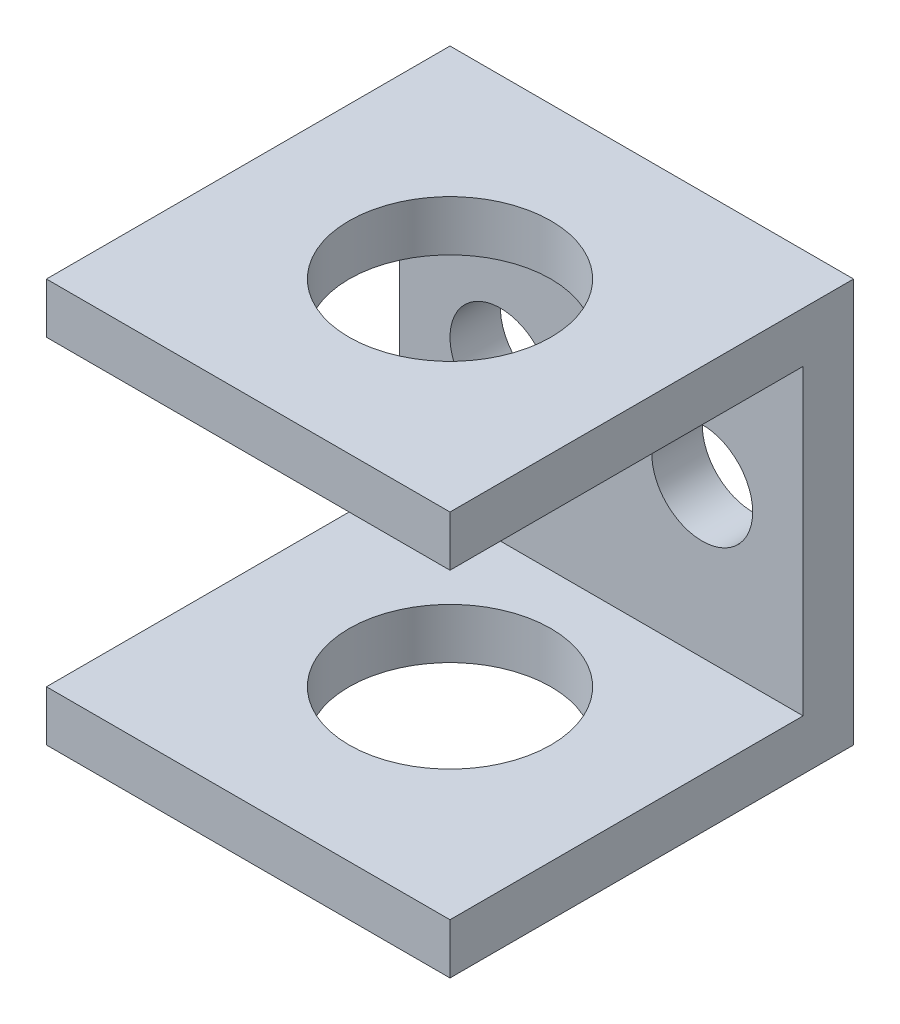
ISO-10303-21;
HEADER;
FILE_DESCRIPTION(('STEP AP214'),'2;1');
FILE_NAME('part.step','',(''),(''),'','','');
FILE_SCHEMA(('AUTOMOTIVE_DESIGN { 1 0 10303 214 1 1 1 1 }'));
ENDSEC;
DATA;
#1=APPLICATION_CONTEXT('core data for automotive mechanical design processes');
#2=APPLICATION_PROTOCOL_DEFINITION('international standard','automotive_design',2000,#1);
#3=PRODUCT_CONTEXT('',#1,'mechanical');
#4=PRODUCT('Part','Part','',(#3));
#5=PRODUCT_RELATED_PRODUCT_CATEGORY('part','',(#4));
#6=PRODUCT_DEFINITION_FORMATION('','',#4);
#7=PRODUCT_DEFINITION_CONTEXT('part definition',#1,'design');
#8=PRODUCT_DEFINITION('design','',#6,#7);
#9=PRODUCT_DEFINITION_SHAPE('','',#8);
#10=(LENGTH_UNIT() NAMED_UNIT(*) SI_UNIT(.MILLI.,.METRE.));
#11=(NAMED_UNIT(*) PLANE_ANGLE_UNIT() SI_UNIT($,.RADIAN.));
#12=(NAMED_UNIT(*) SI_UNIT($,.STERADIAN.) SOLID_ANGLE_UNIT());
#13=UNCERTAINTY_MEASURE_WITH_UNIT(LENGTH_MEASURE(1.E-05),#10,'distance_accuracy_value','');
#14=(GEOMETRIC_REPRESENTATION_CONTEXT(3) GLOBAL_UNCERTAINTY_ASSIGNED_CONTEXT((#13)) GLOBAL_UNIT_ASSIGNED_CONTEXT((#10,
#11,#12)) REPRESENTATION_CONTEXT('',''));
#15=CARTESIAN_POINT('',(0.,0.,0.));
#16=DIRECTION('',(0.,0.,1.));
#17=DIRECTION('',(1.,0.,0.));
#18=AXIS2_PLACEMENT_3D('',#15,#16,#17);
#19=CARTESIAN_POINT('',(0.,0.,20.));
#20=DIRECTION('',(0.,0.,-1.));
#21=DIRECTION('',(-1.,0.,0.));
#22=AXIS2_PLACEMENT_3D('',#19,#20,#21);
#23=PLANE('',#22);
#24=DIRECTION('',(0.,-1.,0.));
#25=VECTOR('',#24,1.);
#26=CARTESIAN_POINT('',(0.,0.,20.));
#27=LINE('',#26,#25);
#28=CARTESIAN_POINT('',(0.,20.,20.));
#29=VERTEX_POINT('',#28);
#30=CARTESIAN_POINT('',(0.,17.5,20.));
#31=VERTEX_POINT('',#30);
#32=EDGE_CURVE('E136',#29,#31,#27,.T.);
#33=ORIENTED_EDGE('',*,*,#32,.T.);
#34=DIRECTION('',(-1.,0.,0.));
#35=VECTOR('',#34,1.);
#36=CARTESIAN_POINT('',(0.,17.5,20.));
#37=LINE('',#36,#35);
#38=CARTESIAN_POINT('',(20.,17.5,20.));
#39=VERTEX_POINT('',#38);
#40=EDGE_CURVE('E127',#39,#31,#37,.T.);
#41=ORIENTED_EDGE('',*,*,#40,.F.);
#42=DIRECTION('',(0.,1.,0.));
#43=VECTOR('',#42,1.);
#44=CARTESIAN_POINT('',(20.,0.,20.));
#45=LINE('',#44,#43);
#46=CARTESIAN_POINT('',(20.,20.,20.));
#47=VERTEX_POINT('',#46);
#48=EDGE_CURVE('E140',#39,#47,#45,.T.);
#49=ORIENTED_EDGE('',*,*,#48,.T.);
#50=DIRECTION('',(-1.,0.,0.));
#51=VECTOR('',#50,1.);
#52=CARTESIAN_POINT('',(0.,20.,20.));
#53=LINE('',#52,#51);
#54=EDGE_CURVE('E61',#47,#29,#53,.T.);
#55=ORIENTED_EDGE('',*,*,#54,.T.);
#56=EDGE_LOOP('',(#33,#41,#49,#55));
#57=FACE_BOUND('',#56,.T.);
#58=ADVANCED_FACE('F36',(#57),#23,.F.);
#59=CARTESIAN_POINT('',(0.,0.,20.));
#60=DIRECTION('',(1.,0.,0.));
#61=DIRECTION('',(0.,0.,-1.));
#62=AXIS2_PLACEMENT_3D('',#59,#60,#61);
#63=PLANE('',#62);
#64=DIRECTION('',(0.,-1.,0.));
#65=VECTOR('',#64,1.);
#66=CARTESIAN_POINT('',(0.,17.5,2.5));
#67=LINE('',#66,#65);
#68=CARTESIAN_POINT('',(0.,17.5,2.5));
#69=VERTEX_POINT('',#68);
#70=CARTESIAN_POINT('',(0.,2.5,2.5));
#71=VERTEX_POINT('',#70);
#72=EDGE_CURVE('E118',#69,#71,#67,.T.);
#73=ORIENTED_EDGE('',*,*,#72,.F.);
#74=DIRECTION('',(0.,0.,1.));
#75=VECTOR('',#74,1.);
#76=CARTESIAN_POINT('',(0.,17.5,2.5));
#77=LINE('',#76,#75);
#78=EDGE_CURVE('E150',#69,#31,#77,.T.);
#79=ORIENTED_EDGE('',*,*,#78,.T.);
#80=ORIENTED_EDGE('',*,*,#32,.F.);
#81=DIRECTION('',(0.,0.,-1.));
#82=VECTOR('',#81,1.);
#83=CARTESIAN_POINT('',(0.,20.,20.));
#84=LINE('',#83,#82);
#85=CARTESIAN_POINT('',(0.,20.,0.));
#86=VERTEX_POINT('',#85);
#87=EDGE_CURVE('E145',#29,#86,#84,.T.);
#88=ORIENTED_EDGE('',*,*,#87,.T.);
#89=DIRECTION('',(0.,-1.,0.));
#90=VECTOR('',#89,1.);
#91=CARTESIAN_POINT('',(0.,0.,0.));
#92=LINE('',#91,#90);
#93=CARTESIAN_POINT('',(0.,0.,0.));
#94=VERTEX_POINT('',#93);
#95=EDGE_CURVE('E146',#86,#94,#92,.T.);
#96=ORIENTED_EDGE('',*,*,#95,.T.);
#97=DIRECTION('',(0.,0.,-1.));
#98=VECTOR('',#97,1.);
#99=CARTESIAN_POINT('',(0.,0.,20.));
#100=LINE('',#99,#98);
#101=CARTESIAN_POINT('',(0.,0.,20.));
#102=VERTEX_POINT('',#101);
#103=EDGE_CURVE('E11',#102,#94,#100,.T.);
#104=ORIENTED_EDGE('',*,*,#103,.F.);
#105=CARTESIAN_POINT('',(0.,2.5,20.));
#106=VERTEX_POINT('',#105);
#107=EDGE_CURVE('E89',#106,#102,#27,.T.);
#108=ORIENTED_EDGE('',*,*,#107,.F.);
#109=DIRECTION('',(0.,0.,1.));
#110=VECTOR('',#109,1.);
#111=CARTESIAN_POINT('',(0.,2.5,2.5));
#112=LINE('',#111,#110);
#113=EDGE_CURVE('E52',#71,#106,#112,.T.);
#114=ORIENTED_EDGE('',*,*,#113,.F.);
#115=EDGE_LOOP('',(#73,#79,#80,#88,#96,#104,#108,#114));
#116=FACE_BOUND('',#115,.T.);
#117=ADVANCED_FACE('F38',(#116),#63,.F.);
#118=CARTESIAN_POINT('',(0.,0.,20.));
#119=DIRECTION('',(0.,1.,0.));
#120=DIRECTION('',(0.,0.,1.));
#121=AXIS2_PLACEMENT_3D('',#118,#119,#120);
#122=PLANE('',#121);
#123=CARTESIAN_POINT('',(10.,0.,10.));
#124=DIRECTION('',(0.,1.,0.));
#125=DIRECTION('',(0.,0.,1.));
#126=AXIS2_PLACEMENT_3D('',#123,#124,#125);
#127=CIRCLE('',#126,5.);
#128=CARTESIAN_POINT('',(10.,0.,15.));
#129=VERTEX_POINT('',#128);
#130=EDGE_CURVE('E215',#129,#129,#127,.T.);
#131=ORIENTED_EDGE('',*,*,#130,.T.);
#132=EDGE_LOOP('',(#131));
#133=FACE_BOUND('',#132,.T.);
#134=DIRECTION('',(1.,0.,0.));
#135=VECTOR('',#134,1.);
#136=CARTESIAN_POINT('',(0.,0.,0.));
#137=LINE('',#136,#135);
#138=CARTESIAN_POINT('',(20.,0.,0.));
#139=VERTEX_POINT('',#138);
#140=EDGE_CURVE('E149',#94,#139,#137,.T.);
#141=ORIENTED_EDGE('',*,*,#140,.T.);
#142=DIRECTION('',(0.,0.,-1.));
#143=VECTOR('',#142,1.);
#144=CARTESIAN_POINT('',(20.,0.,20.));
#145=LINE('',#144,#143);
#146=CARTESIAN_POINT('',(20.,0.,20.));
#147=VERTEX_POINT('',#146);
#148=EDGE_CURVE('E45',#147,#139,#145,.T.);
#149=ORIENTED_EDGE('',*,*,#148,.F.);
#150=DIRECTION('',(1.,0.,0.));
#151=VECTOR('',#150,1.);
#152=CARTESIAN_POINT('',(0.,0.,20.));
#153=LINE('',#152,#151);
#154=EDGE_CURVE('E138',#102,#147,#153,.T.);
#155=ORIENTED_EDGE('',*,*,#154,.F.);
#156=ORIENTED_EDGE('',*,*,#103,.T.);
#157=EDGE_LOOP('',(#141,#149,#155,#156));
#158=FACE_BOUND('',#157,.T.);
#159=ADVANCED_FACE('F200',(#133,#158),#122,.F.);
#160=CARTESIAN_POINT('',(20.,0.,20.));
#161=DIRECTION('',(-1.,0.,0.));
#162=DIRECTION('',(0.,0.,1.));
#163=AXIS2_PLACEMENT_3D('',#160,#161,#162);
#164=PLANE('',#163);
#165=ORIENTED_EDGE('',*,*,#48,.F.);
#166=DIRECTION('',(0.,0.,1.));
#167=VECTOR('',#166,1.);
#168=CARTESIAN_POINT('',(20.,17.5,2.5));
#169=LINE('',#168,#167);
#170=CARTESIAN_POINT('',(20.,17.5,2.5));
#171=VERTEX_POINT('',#170);
#172=EDGE_CURVE('E131',#171,#39,#169,.T.);
#173=ORIENTED_EDGE('',*,*,#172,.F.);
#174=DIRECTION('',(0.,1.,0.));
#175=VECTOR('',#174,1.);
#176=CARTESIAN_POINT('',(20.,17.5,2.5));
#177=LINE('',#176,#175);
#178=CARTESIAN_POINT('',(20.,2.5,2.5));
#179=VERTEX_POINT('',#178);
#180=EDGE_CURVE('E117',#179,#171,#177,.T.);
#181=ORIENTED_EDGE('',*,*,#180,.F.);
#182=DIRECTION('',(0.,0.,1.));
#183=VECTOR('',#182,1.);
#184=CARTESIAN_POINT('',(20.,2.5,2.5));
#185=LINE('',#184,#183);
#186=CARTESIAN_POINT('',(20.,2.5,20.));
#187=VERTEX_POINT('',#186);
#188=EDGE_CURVE('E114',#179,#187,#185,.T.);
#189=ORIENTED_EDGE('',*,*,#188,.T.);
#190=EDGE_CURVE('E141',#147,#187,#45,.T.);
#191=ORIENTED_EDGE('',*,*,#190,.F.);
#192=ORIENTED_EDGE('',*,*,#148,.T.);
#193=DIRECTION('',(0.,1.,0.));
#194=VECTOR('',#193,1.);
#195=CARTESIAN_POINT('',(20.,0.,0.));
#196=LINE('',#195,#194);
#197=CARTESIAN_POINT('',(20.,20.,0.));
#198=VERTEX_POINT('',#197);
#199=EDGE_CURVE('E152',#139,#198,#196,.T.);
#200=ORIENTED_EDGE('',*,*,#199,.T.);
#201=DIRECTION('',(0.,0.,-1.));
#202=VECTOR('',#201,1.);
#203=CARTESIAN_POINT('',(20.,20.,20.));
#204=LINE('',#203,#202);
#205=EDGE_CURVE('E156',#47,#198,#204,.T.);
#206=ORIENTED_EDGE('',*,*,#205,.F.);
#207=EDGE_LOOP('',(#165,#173,#181,#189,#191,#192,#200,#206));
#208=FACE_BOUND('',#207,.T.);
#209=ADVANCED_FACE('F164',(#208),#164,.F.);
#210=CARTESIAN_POINT('',(0.,20.,20.));
#211=DIRECTION('',(0.,-1.,0.));
#212=DIRECTION('',(0.,0.,-1.));
#213=AXIS2_PLACEMENT_3D('',#210,#211,#212);
#214=PLANE('',#213);
#215=CARTESIAN_POINT('',(10.,20.,10.));
#216=DIRECTION('',(0.,1.,0.));
#217=DIRECTION('',(0.,0.,1.));
#218=AXIS2_PLACEMENT_3D('',#215,#216,#217);
#219=CIRCLE('',#218,5.);
#220=CARTESIAN_POINT('',(10.,20.,15.));
#221=VERTEX_POINT('',#220);
#222=EDGE_CURVE('E217',#221,#221,#219,.T.);
#223=ORIENTED_EDGE('',*,*,#222,.F.);
#224=EDGE_LOOP('',(#223));
#225=FACE_BOUND('',#224,.T.);
#226=DIRECTION('',(-1.,0.,0.));
#227=VECTOR('',#226,1.);
#228=CARTESIAN_POINT('',(0.,20.,0.));
#229=LINE('',#228,#227);
#230=EDGE_CURVE('E82',#198,#86,#229,.T.);
#231=ORIENTED_EDGE('',*,*,#230,.T.);
#232=ORIENTED_EDGE('',*,*,#87,.F.);
#233=ORIENTED_EDGE('',*,*,#54,.F.);
#234=ORIENTED_EDGE('',*,*,#205,.T.);
#235=EDGE_LOOP('',(#231,#232,#233,#234));
#236=FACE_BOUND('',#235,.T.);
#237=ADVANCED_FACE('F171',(#225,#236),#214,.F.);
#238=ORIENTED_EDGE('',*,*,#190,.T.);
#239=DIRECTION('',(1.,0.,0.));
#240=VECTOR('',#239,1.);
#241=CARTESIAN_POINT('',(0.,2.5,20.));
#242=LINE('',#241,#240);
#243=EDGE_CURVE('E175',#106,#187,#242,.T.);
#244=ORIENTED_EDGE('',*,*,#243,.F.);
#245=ORIENTED_EDGE('',*,*,#107,.T.);
#246=ORIENTED_EDGE('',*,*,#154,.T.);
#247=EDGE_LOOP('',(#238,#244,#245,#246));
#248=FACE_BOUND('',#247,.T.);
#249=ADVANCED_FACE('F190',(#248),#23,.F.);
#250=CARTESIAN_POINT('',(0.,0.,0.));
#251=DIRECTION('',(0.,0.,-1.));
#252=DIRECTION('',(-1.,0.,0.));
#253=AXIS2_PLACEMENT_3D('',#250,#251,#252);
#254=PLANE('',#253);
#255=CARTESIAN_POINT('',(15.,10.,0.));
#256=DIRECTION('',(0.,0.,1.));
#257=DIRECTION('',(1.,0.,0.));
#258=AXIS2_PLACEMENT_3D('',#255,#256,#257);
#259=CIRCLE('',#258,2.5);
#260=CARTESIAN_POINT('',(17.5,10.,0.));
#261=VERTEX_POINT('',#260);
#262=EDGE_CURVE('E221',#261,#261,#259,.T.);
#263=ORIENTED_EDGE('',*,*,#262,.T.);
#264=EDGE_LOOP('',(#263));
#265=FACE_BOUND('',#264,.T.);
#266=CARTESIAN_POINT('',(5.,10.,0.));
#267=DIRECTION('',(0.,0.,1.));
#268=DIRECTION('',(1.,0.,0.));
#269=AXIS2_PLACEMENT_3D('',#266,#267,#268);
#270=CIRCLE('',#269,2.5);
#271=CARTESIAN_POINT('',(7.5,10.,0.));
#272=VERTEX_POINT('',#271);
#273=EDGE_CURVE('E255',#272,#272,#270,.T.);
#274=ORIENTED_EDGE('',*,*,#273,.T.);
#275=EDGE_LOOP('',(#274));
#276=FACE_BOUND('',#275,.T.);
#277=ORIENTED_EDGE('',*,*,#95,.F.);
#278=ORIENTED_EDGE('',*,*,#230,.F.);
#279=ORIENTED_EDGE('',*,*,#199,.F.);
#280=ORIENTED_EDGE('',*,*,#140,.F.);
#281=EDGE_LOOP('',(#277,#278,#279,#280));
#282=FACE_BOUND('',#281,.T.);
#283=ADVANCED_FACE('F169',(#265,#276,#282),#254,.T.);
#284=CARTESIAN_POINT('',(0.,17.5,2.5));
#285=DIRECTION('',(0.,1.,0.));
#286=DIRECTION('',(0.,0.,1.));
#287=AXIS2_PLACEMENT_3D('',#284,#285,#286);
#288=PLANE('',#287);
#289=CARTESIAN_POINT('',(10.,17.5,10.));
#290=DIRECTION('',(0.,1.,0.));
#291=DIRECTION('',(0.,0.,1.));
#292=AXIS2_PLACEMENT_3D('',#289,#290,#291);
#293=CIRCLE('',#292,5.);
#294=CARTESIAN_POINT('',(10.,17.5,15.));
#295=VERTEX_POINT('',#294);
#296=EDGE_CURVE('E177',#295,#295,#293,.T.);
#297=ORIENTED_EDGE('',*,*,#296,.T.);
#298=EDGE_LOOP('',(#297));
#299=FACE_BOUND('',#298,.T.);
#300=ORIENTED_EDGE('',*,*,#40,.T.);
#301=ORIENTED_EDGE('',*,*,#78,.F.);
#302=DIRECTION('',(-1.,0.,0.));
#303=VECTOR('',#302,1.);
#304=CARTESIAN_POINT('',(0.,17.5,2.5));
#305=LINE('',#304,#303);
#306=EDGE_CURVE('E124',#171,#69,#305,.T.);
#307=ORIENTED_EDGE('',*,*,#306,.F.);
#308=ORIENTED_EDGE('',*,*,#172,.T.);
#309=EDGE_LOOP('',(#300,#301,#307,#308));
#310=FACE_BOUND('',#309,.T.);
#311=ADVANCED_FACE('F180',(#299,#310),#288,.F.);
#312=CARTESIAN_POINT('',(0.,2.5,2.5));
#313=DIRECTION('',(0.,-1.,0.));
#314=DIRECTION('',(0.,0.,-1.));
#315=AXIS2_PLACEMENT_3D('',#312,#313,#314);
#316=PLANE('',#315);
#317=CARTESIAN_POINT('',(10.,2.5,10.));
#318=DIRECTION('',(0.,-1.,0.));
#319=DIRECTION('',(0.,0.,-1.));
#320=AXIS2_PLACEMENT_3D('',#317,#318,#319);
#321=CIRCLE('',#320,5.);
#322=CARTESIAN_POINT('',(10.,2.5,5.));
#323=VERTEX_POINT('',#322);
#324=EDGE_CURVE('E40',#323,#323,#321,.T.);
#325=ORIENTED_EDGE('',*,*,#324,.T.);
#326=EDGE_LOOP('',(#325));
#327=FACE_BOUND('',#326,.T.);
#328=ORIENTED_EDGE('',*,*,#243,.T.);
#329=ORIENTED_EDGE('',*,*,#188,.F.);
#330=DIRECTION('',(1.,0.,0.));
#331=VECTOR('',#330,1.);
#332=CARTESIAN_POINT('',(0.,2.5,2.5));
#333=LINE('',#332,#331);
#334=EDGE_CURVE('E110',#71,#179,#333,.T.);
#335=ORIENTED_EDGE('',*,*,#334,.F.);
#336=ORIENTED_EDGE('',*,*,#113,.T.);
#337=EDGE_LOOP('',(#328,#329,#335,#336));
#338=FACE_BOUND('',#337,.T.);
#339=ADVANCED_FACE('F112',(#327,#338),#316,.F.);
#340=CARTESIAN_POINT('',(0.,0.,2.5));
#341=DIRECTION('',(0.,0.,1.));
#342=DIRECTION('',(1.,0.,0.));
#343=AXIS2_PLACEMENT_3D('',#340,#341,#342);
#344=PLANE('',#343);
#345=CARTESIAN_POINT('',(15.,10.,2.5));
#346=DIRECTION('',(0.,0.,1.));
#347=DIRECTION('',(1.,0.,0.));
#348=AXIS2_PLACEMENT_3D('',#345,#346,#347);
#349=CIRCLE('',#348,2.5);
#350=CARTESIAN_POINT('',(17.5,10.,2.5));
#351=VERTEX_POINT('',#350);
#352=EDGE_CURVE('E251',#351,#351,#349,.T.);
#353=ORIENTED_EDGE('',*,*,#352,.F.);
#354=EDGE_LOOP('',(#353));
#355=FACE_BOUND('',#354,.T.);
#356=CARTESIAN_POINT('',(5.,10.,2.5));
#357=DIRECTION('',(0.,0.,1.));
#358=DIRECTION('',(1.,0.,0.));
#359=AXIS2_PLACEMENT_3D('',#356,#357,#358);
#360=CIRCLE('',#359,2.5);
#361=CARTESIAN_POINT('',(7.5,10.,2.5));
#362=VERTEX_POINT('',#361);
#363=EDGE_CURVE('E224',#362,#362,#360,.T.);
#364=ORIENTED_EDGE('',*,*,#363,.F.);
#365=EDGE_LOOP('',(#364));
#366=FACE_BOUND('',#365,.T.);
#367=ORIENTED_EDGE('',*,*,#72,.T.);
#368=ORIENTED_EDGE('',*,*,#334,.T.);
#369=ORIENTED_EDGE('',*,*,#180,.T.);
#370=ORIENTED_EDGE('',*,*,#306,.T.);
#371=EDGE_LOOP('',(#367,#368,#369,#370));
#372=FACE_BOUND('',#371,.T.);
#373=ADVANCED_FACE('F122',(#355,#366,#372),#344,.T.);
#374=CARTESIAN_POINT('',(10.,0.,10.));
#375=DIRECTION('',(0.,1.,0.));
#376=DIRECTION('',(0.,0.,1.));
#377=AXIS2_PLACEMENT_3D('',#374,#375,#376);
#378=CYLINDRICAL_SURFACE('',#377,5.);
#379=ORIENTED_EDGE('',*,*,#130,.F.);
#380=EDGE_LOOP('',(#379));
#381=FACE_BOUND('',#380,.T.);
#382=ORIENTED_EDGE('',*,*,#324,.F.);
#383=EDGE_LOOP('',(#382));
#384=FACE_BOUND('',#383,.T.);
#385=ADVANCED_FACE('F233',(#381,#384),#378,.F.);
#386=ORIENTED_EDGE('',*,*,#222,.T.);
#387=EDGE_LOOP('',(#386));
#388=FACE_BOUND('',#387,.T.);
#389=ORIENTED_EDGE('',*,*,#296,.F.);
#390=EDGE_LOOP('',(#389));
#391=FACE_BOUND('',#390,.T.);
#392=ADVANCED_FACE('F230',(#388,#391),#378,.F.);
#393=CARTESIAN_POINT('',(5.,10.,0.));
#394=DIRECTION('',(0.,0.,1.));
#395=DIRECTION('',(1.,0.,0.));
#396=AXIS2_PLACEMENT_3D('',#393,#394,#395);
#397=CYLINDRICAL_SURFACE('',#396,2.5);
#398=ORIENTED_EDGE('',*,*,#273,.F.);
#399=EDGE_LOOP('',(#398));
#400=FACE_BOUND('',#399,.T.);
#401=ORIENTED_EDGE('',*,*,#363,.T.);
#402=EDGE_LOOP('',(#401));
#403=FACE_BOUND('',#402,.T.);
#404=ADVANCED_FACE('F232',(#400,#403),#397,.F.);
#405=CARTESIAN_POINT('',(15.,10.,0.));
#406=DIRECTION('',(0.,0.,1.));
#407=DIRECTION('',(1.,0.,0.));
#408=AXIS2_PLACEMENT_3D('',#405,#406,#407);
#409=CYLINDRICAL_SURFACE('',#408,2.5);
#410=ORIENTED_EDGE('',*,*,#262,.F.);
#411=EDGE_LOOP('',(#410));
#412=FACE_BOUND('',#411,.T.);
#413=ORIENTED_EDGE('',*,*,#352,.T.);
#414=EDGE_LOOP('',(#413));
#415=FACE_BOUND('',#414,.T.);
#416=ADVANCED_FACE('F240',(#412,#415),#409,.F.);
#417=CLOSED_SHELL('',(#58,#117,#159,#209,#237,#249,#283,#311,#339,#373,#385,#392,#404,#416));
#418=MANIFOLD_SOLID_BREP('B2',#417);
#419=ADVANCED_BREP_SHAPE_REPRESENTATION('',(#18,#418),#14);
#420=SHAPE_DEFINITION_REPRESENTATION(#9,#419);
ENDSEC;
END-ISO-10303-21;
